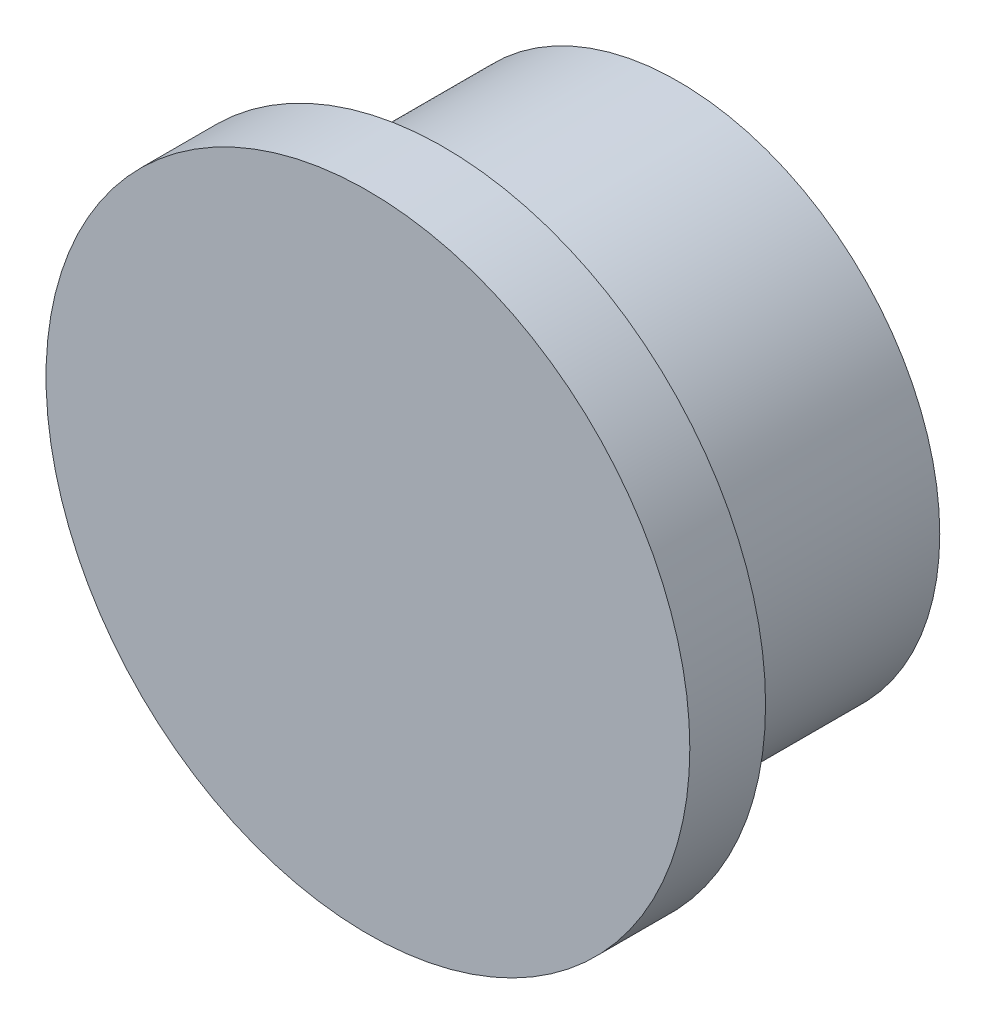
ISO-10303-21;
HEADER;
FILE_DESCRIPTION(('STEP AP214'),'2;1');
FILE_NAME('part.step','',(''),(''),'','','');
FILE_SCHEMA(('AUTOMOTIVE_DESIGN { 1 0 10303 214 1 1 1 1 }'));
ENDSEC;
DATA;
#1=APPLICATION_CONTEXT('core data for automotive mechanical design processes');
#2=APPLICATION_PROTOCOL_DEFINITION('international standard','automotive_design',2000,#1);
#3=PRODUCT_CONTEXT('',#1,'mechanical');
#4=PRODUCT('Part','Part','',(#3));
#5=PRODUCT_RELATED_PRODUCT_CATEGORY('part','',(#4));
#6=PRODUCT_DEFINITION_FORMATION('','',#4);
#7=PRODUCT_DEFINITION_CONTEXT('part definition',#1,'design');
#8=PRODUCT_DEFINITION('design','',#6,#7);
#9=PRODUCT_DEFINITION_SHAPE('','',#8);
#10=(LENGTH_UNIT() NAMED_UNIT(*) SI_UNIT(.MILLI.,.METRE.));
#11=(NAMED_UNIT(*) PLANE_ANGLE_UNIT() SI_UNIT($,.RADIAN.));
#12=(NAMED_UNIT(*) SI_UNIT($,.STERADIAN.) SOLID_ANGLE_UNIT());
#13=UNCERTAINTY_MEASURE_WITH_UNIT(LENGTH_MEASURE(1.E-05),#10,'distance_accuracy_value','');
#14=(GEOMETRIC_REPRESENTATION_CONTEXT(3) GLOBAL_UNCERTAINTY_ASSIGNED_CONTEXT((#13)) GLOBAL_UNIT_ASSIGNED_CONTEXT((#10,
#11,#12)) REPRESENTATION_CONTEXT('',''));
#15=CARTESIAN_POINT('',(0.,0.,0.));
#16=DIRECTION('',(0.,0.,1.));
#17=DIRECTION('',(1.,0.,0.));
#18=AXIS2_PLACEMENT_3D('',#15,#16,#17);
#19=CARTESIAN_POINT('',(0.,0.,0.));
#20=DIRECTION('',(0.,0.,1.));
#21=DIRECTION('',(1.,0.,0.));
#22=AXIS2_PLACEMENT_3D('',#19,#20,#21);
#23=PLANE('',#22);
#24=CARTESIAN_POINT('',(0.,0.,0.));
#25=DIRECTION('',(0.,0.,1.));
#26=DIRECTION('',(1.,0.,0.));
#27=AXIS2_PLACEMENT_3D('',#24,#25,#26);
#28=CIRCLE('',#27,3.45);
#29=CARTESIAN_POINT('',(3.45,0.,0.));
#30=VERTEX_POINT('',#29);
#31=EDGE_CURVE('E45',#30,#30,#28,.T.);
#32=ORIENTED_EDGE('',*,*,#31,.F.);
#33=EDGE_LOOP('',(#32));
#34=FACE_BOUND('',#33,.T.);
#35=CARTESIAN_POINT('',(0.,0.,0.));
#36=DIRECTION('',(0.,0.,1.));
#37=DIRECTION('',(1.,0.,0.));
#38=AXIS2_PLACEMENT_3D('',#35,#36,#37);
#39=CIRCLE('',#38,2.45);
#40=CARTESIAN_POINT('',(2.45,0.,0.));
#41=VERTEX_POINT('',#40);
#42=EDGE_CURVE('E54',#41,#41,#39,.T.);
#43=ORIENTED_EDGE('',*,*,#42,.T.);
#44=EDGE_LOOP('',(#43));
#45=FACE_BOUND('',#44,.T.);
#46=ADVANCED_FACE('F41',(#34,#45),#23,.F.);
#47=CARTESIAN_POINT('',(0.,0.,3.1));
#48=DIRECTION('',(0.,0.,-1.));
#49=DIRECTION('',(-1.,0.,0.));
#50=AXIS2_PLACEMENT_3D('',#47,#48,#49);
#51=CYLINDRICAL_SURFACE('',#50,3.45);
#52=CARTESIAN_POINT('',(0.,0.,3.1));
#53=DIRECTION('',(0.,0.,1.));
#54=DIRECTION('',(1.,0.,0.));
#55=AXIS2_PLACEMENT_3D('',#52,#53,#54);
#56=CIRCLE('',#55,3.45);
#57=CARTESIAN_POINT('',(3.45,0.,3.1));
#58=VERTEX_POINT('',#57);
#59=EDGE_CURVE('E10',#58,#58,#56,.T.);
#60=ORIENTED_EDGE('',*,*,#59,.F.);
#61=EDGE_LOOP('',(#60));
#62=FACE_BOUND('',#61,.T.);
#63=ORIENTED_EDGE('',*,*,#31,.T.);
#64=EDGE_LOOP('',(#63));
#65=FACE_BOUND('',#64,.T.);
#66=ADVANCED_FACE('F43',(#62,#65),#51,.T.);
#67=CARTESIAN_POINT('',(0.,0.,3.1));
#68=DIRECTION('',(0.,0.,-1.));
#69=DIRECTION('',(-1.,0.,0.));
#70=AXIS2_PLACEMENT_3D('',#67,#68,#69);
#71=CYLINDRICAL_SURFACE('',#70,2.45);
#72=CARTESIAN_POINT('',(0.,0.,3.1));
#73=DIRECTION('',(0.,0.,1.));
#74=DIRECTION('',(1.,0.,0.));
#75=AXIS2_PLACEMENT_3D('',#72,#73,#74);
#76=CIRCLE('',#75,2.45);
#77=CARTESIAN_POINT('',(2.45,0.,3.1));
#78=VERTEX_POINT('',#77);
#79=EDGE_CURVE('E59',#78,#78,#76,.T.);
#80=ORIENTED_EDGE('',*,*,#79,.T.);
#81=EDGE_LOOP('',(#80));
#82=FACE_BOUND('',#81,.T.);
#83=ORIENTED_EDGE('',*,*,#42,.F.);
#84=EDGE_LOOP('',(#83));
#85=FACE_BOUND('',#84,.T.);
#86=ADVANCED_FACE('F89',(#82,#85),#71,.F.);
#87=CARTESIAN_POINT('',(0.,0.,3.1));
#88=DIRECTION('',(0.,0.,1.));
#89=DIRECTION('',(1.,0.,0.));
#90=AXIS2_PLACEMENT_3D('',#87,#88,#89);
#91=PLANE('',#90);
#92=ORIENTED_EDGE('',*,*,#79,.F.);
#93=EDGE_LOOP('',(#92));
#94=FACE_BOUND('',#93,.T.);
#95=ADVANCED_FACE('F77',(#94),#91,.F.);
#96=CARTESIAN_POINT('',(0.,0.,4.1));
#97=DIRECTION('',(0.,0.,-1.));
#98=DIRECTION('',(-1.,0.,0.));
#99=AXIS2_PLACEMENT_3D('',#96,#97,#98);
#100=CYLINDRICAL_SURFACE('',#99,4.25);
#101=CARTESIAN_POINT('',(0.,0.,4.1));
#102=DIRECTION('',(0.,0.,1.));
#103=DIRECTION('',(1.,0.,0.));
#104=AXIS2_PLACEMENT_3D('',#101,#102,#103);
#105=CIRCLE('',#104,4.25);
#106=CARTESIAN_POINT('',(4.25,0.,4.1));
#107=VERTEX_POINT('',#106);
#108=EDGE_CURVE('E63',#107,#107,#105,.T.);
#109=ORIENTED_EDGE('',*,*,#108,.F.);
#110=EDGE_LOOP('',(#109));
#111=FACE_BOUND('',#110,.T.);
#112=CARTESIAN_POINT('',(0.,0.,3.1));
#113=DIRECTION('',(0.,0.,1.));
#114=DIRECTION('',(1.,0.,0.));
#115=AXIS2_PLACEMENT_3D('',#112,#113,#114);
#116=CIRCLE('',#115,4.25);
#117=CARTESIAN_POINT('',(4.25,0.,3.1));
#118=VERTEX_POINT('',#117);
#119=EDGE_CURVE('E64',#118,#118,#116,.T.);
#120=ORIENTED_EDGE('',*,*,#119,.T.);
#121=EDGE_LOOP('',(#120));
#122=FACE_BOUND('',#121,.T.);
#123=ADVANCED_FACE('F74',(#111,#122),#100,.T.);
#124=CARTESIAN_POINT('',(0.,0.,4.1));
#125=DIRECTION('',(0.,0.,1.));
#126=DIRECTION('',(1.,0.,0.));
#127=AXIS2_PLACEMENT_3D('',#124,#125,#126);
#128=PLANE('',#127);
#129=ORIENTED_EDGE('',*,*,#108,.T.);
#130=EDGE_LOOP('',(#129));
#131=FACE_BOUND('',#130,.T.);
#132=ADVANCED_FACE('F72',(#131),#128,.T.);
#133=ORIENTED_EDGE('',*,*,#59,.T.);
#134=EDGE_LOOP('',(#133));
#135=FACE_BOUND('',#134,.T.);
#136=ORIENTED_EDGE('',*,*,#119,.F.);
#137=EDGE_LOOP('',(#136));
#138=FACE_BOUND('',#137,.T.);
#139=ADVANCED_FACE('F81',(#135,#138),#91,.F.);
#140=CLOSED_SHELL('',(#46,#66,#86,#95,#123,#132,#139));
#141=MANIFOLD_SOLID_BREP('B2',#140);
#142=ADVANCED_BREP_SHAPE_REPRESENTATION('',(#18,#141),#14);
#143=SHAPE_DEFINITION_REPRESENTATION(#9,#142);
ENDSEC;
END-ISO-10303-21;
